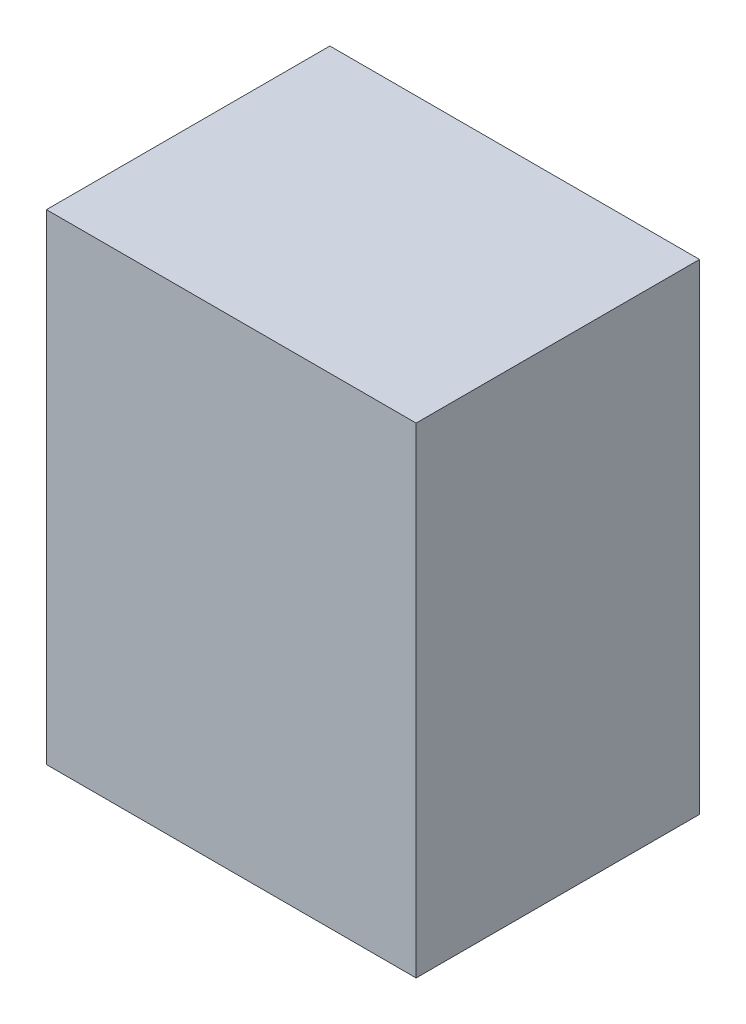
ISO-10303-21;
HEADER;
FILE_DESCRIPTION(('STEP AP214'),'2;1');
FILE_NAME('part.step','',(''),(''),'','','');
FILE_SCHEMA(('AUTOMOTIVE_DESIGN { 1 0 10303 214 1 1 1 1 }'));
ENDSEC;
DATA;
#1=APPLICATION_CONTEXT('core data for automotive mechanical design processes');
#2=APPLICATION_PROTOCOL_DEFINITION('international standard','automotive_design',2000,#1);
#3=PRODUCT_CONTEXT('',#1,'mechanical');
#4=PRODUCT('Part','Part','',(#3));
#5=PRODUCT_RELATED_PRODUCT_CATEGORY('part','',(#4));
#6=PRODUCT_DEFINITION_FORMATION('','',#4);
#7=PRODUCT_DEFINITION_CONTEXT('part definition',#1,'design');
#8=PRODUCT_DEFINITION('design','',#6,#7);
#9=PRODUCT_DEFINITION_SHAPE('','',#8);
#10=(LENGTH_UNIT() NAMED_UNIT(*) SI_UNIT(.MILLI.,.METRE.));
#11=(NAMED_UNIT(*) PLANE_ANGLE_UNIT() SI_UNIT($,.RADIAN.));
#12=(NAMED_UNIT(*) SI_UNIT($,.STERADIAN.) SOLID_ANGLE_UNIT());
#13=UNCERTAINTY_MEASURE_WITH_UNIT(LENGTH_MEASURE(1.E-05),#10,'distance_accuracy_value','');
#14=(GEOMETRIC_REPRESENTATION_CONTEXT(3) GLOBAL_UNCERTAINTY_ASSIGNED_CONTEXT((#13)) GLOBAL_UNIT_ASSIGNED_CONTEXT((#10,
#11,#12)) REPRESENTATION_CONTEXT('',''));
#15=CARTESIAN_POINT('',(0.,0.,0.));
#16=DIRECTION('',(0.,0.,1.));
#17=DIRECTION('',(1.,0.,0.));
#18=AXIS2_PLACEMENT_3D('',#15,#16,#17);
#19=CARTESIAN_POINT('',(-0.7499985,0.97499932,1.15000024));
#20=DIRECTION('',(0.,0.,1.));
#21=DIRECTION('',(1.,0.,0.));
#22=AXIS2_PLACEMENT_3D('',#19,#20,#21);
#23=PLANE('',#22);
#24=DIRECTION('',(0.,1.,0.));
#25=VECTOR('',#24,1.);
#26=CARTESIAN_POINT('',(0.75000104,0.97500186,1.15000024));
#27=LINE('',#26,#25);
#28=CARTESIAN_POINT('',(0.75000104,0.975001859999999,1.15000024));
#29=VERTEX_POINT('',#28);
#30=CARTESIAN_POINT('',(0.75000104,-0.97500059,1.15000024));
#31=VERTEX_POINT('',#30);
#32=EDGE_CURVE('E52',#29,#31,#27,.F.);
#33=ORIENTED_EDGE('',*,*,#32,.F.);
#34=DIRECTION('',(1.,0.,0.));
#35=VECTOR('',#34,1.);
#36=CARTESIAN_POINT('',(-0.7499985,0.97500186,1.15000024));
#37=LINE('',#36,#35);
#38=CARTESIAN_POINT('',(-0.7499985,0.97500059,1.15000024));
#39=VERTEX_POINT('',#38);
#40=EDGE_CURVE('E19',#29,#39,#37,.F.);
#41=ORIENTED_EDGE('',*,*,#40,.T.);
#42=DIRECTION('',(0.,1.,0.));
#43=VECTOR('',#42,1.);
#44=CARTESIAN_POINT('',(-0.7499985,-0.97499932,1.15000024));
#45=LINE('',#44,#43);
#46=CARTESIAN_POINT('',(-0.7499985,-0.974999320000001,1.15000024));
#47=VERTEX_POINT('',#46);
#48=EDGE_CURVE('E66',#47,#39,#45,.T.);
#49=ORIENTED_EDGE('',*,*,#48,.F.);
#50=DIRECTION('',(0.999999999998566,-1.69333385061627E-06,0.));
#51=VECTOR('',#50,1.);
#52=CARTESIAN_POINT('',(0.75000104,-0.97500186,1.15000024));
#53=LINE('',#52,#51);
#54=EDGE_CURVE('E57',#31,#47,#53,.F.);
#55=ORIENTED_EDGE('',*,*,#54,.F.);
#56=EDGE_LOOP('',(#33,#41,#49,#55));
#57=FACE_BOUND('',#56,.T.);
#58=ADVANCED_FACE('F16',(#57),#23,.T.);
#59=CARTESIAN_POINT('',(-0.7499985,-0.97499932,0.));
#60=DIRECTION('',(-1.,0.,0.));
#61=DIRECTION('',(0.,0.,1.));
#62=AXIS2_PLACEMENT_3D('',#59,#60,#61);
#63=PLANE('',#62);
#64=DIRECTION('',(0.,0.,1.));
#65=VECTOR('',#64,1.);
#66=CARTESIAN_POINT('',(-0.7499985,0.97499932,0.));
#67=LINE('',#66,#65);
#68=CARTESIAN_POINT('',(-0.7499985,0.974999955,0.));
#69=VERTEX_POINT('',#68);
#70=EDGE_CURVE('E79',#69,#39,#67,.T.);
#71=ORIENTED_EDGE('',*,*,#70,.F.);
#72=DIRECTION('',(0.,1.,0.));
#73=VECTOR('',#72,1.);
#74=CARTESIAN_POINT('',(-0.7499985,0.97499932,0.));
#75=LINE('',#74,#73);
#76=CARTESIAN_POINT('',(-0.7499985,-0.974999320000001,0.));
#77=VERTEX_POINT('',#76);
#78=EDGE_CURVE('E74',#69,#77,#75,.F.);
#79=ORIENTED_EDGE('',*,*,#78,.T.);
#80=DIRECTION('',(0.,0.,1.));
#81=VECTOR('',#80,1.);
#82=CARTESIAN_POINT('',(-0.7499985,-0.974999320000003,0.));
#83=LINE('',#82,#81);
#84=EDGE_CURVE('E62',#47,#77,#83,.F.);
#85=ORIENTED_EDGE('',*,*,#84,.F.);
#86=ORIENTED_EDGE('',*,*,#48,.T.);
#87=EDGE_LOOP('',(#71,#79,#85,#86));
#88=FACE_BOUND('',#87,.T.);
#89=ADVANCED_FACE('F73',(#88),#63,.T.);
#90=CARTESIAN_POINT('',(0.75000104,-0.97500186,0.));
#91=DIRECTION('',(-1.69333385061627E-06,-0.999999999998566,0.));
#92=DIRECTION('',(0.999999999998566,-1.69333385061627E-06,0.));
#93=AXIS2_PLACEMENT_3D('',#90,#91,#92);
#94=PLANE('',#93);
#95=ORIENTED_EDGE('',*,*,#84,.T.);
#96=DIRECTION('',(1.,0.,0.));
#97=VECTOR('',#96,1.);
#98=CARTESIAN_POINT('',(-0.7499985,-0.97499932,0.));
#99=LINE('',#98,#97);
#100=CARTESIAN_POINT('',(0.75000104,-0.975001225,0.));
#101=VERTEX_POINT('',#100);
#102=EDGE_CURVE('E83',#77,#101,#99,.T.);
#103=ORIENTED_EDGE('',*,*,#102,.T.);
#104=DIRECTION('',(0.,0.,-1.));
#105=VECTOR('',#104,1.);
#106=CARTESIAN_POINT('',(0.75000104,-0.97500186,0.));
#107=LINE('',#106,#105);
#108=EDGE_CURVE('E64',#31,#101,#107,.T.);
#109=ORIENTED_EDGE('',*,*,#108,.F.);
#110=ORIENTED_EDGE('',*,*,#54,.T.);
#111=EDGE_LOOP('',(#95,#103,#109,#110));
#112=FACE_BOUND('',#111,.T.);
#113=ADVANCED_FACE('F59',(#112),#94,.T.);
#114=CARTESIAN_POINT('',(0.75000104,0.97500186,0.));
#115=DIRECTION('',(1.,0.,0.));
#116=DIRECTION('',(0.,0.,-1.));
#117=AXIS2_PLACEMENT_3D('',#114,#115,#116);
#118=PLANE('',#117);
#119=ORIENTED_EDGE('',*,*,#108,.T.);
#120=DIRECTION('',(0.,1.,0.));
#121=VECTOR('',#120,1.);
#122=CARTESIAN_POINT('',(0.75000104,0.97499932,0.));
#123=LINE('',#122,#121);
#124=CARTESIAN_POINT('',(0.75000104,0.975001859999999,0.));
#125=VERTEX_POINT('',#124);
#126=EDGE_CURVE('E25',#101,#125,#123,.T.);
#127=ORIENTED_EDGE('',*,*,#126,.T.);
#128=DIRECTION('',(0.,0.,1.));
#129=VECTOR('',#128,1.);
#130=CARTESIAN_POINT('',(0.75000104,0.975001859999997,0.));
#131=LINE('',#130,#129);
#132=EDGE_CURVE('E33',#29,#125,#131,.F.);
#133=ORIENTED_EDGE('',*,*,#132,.F.);
#134=ORIENTED_EDGE('',*,*,#32,.T.);
#135=EDGE_LOOP('',(#119,#127,#133,#134));
#136=FACE_BOUND('',#135,.T.);
#137=ADVANCED_FACE('F87',(#136),#118,.T.);
#138=CARTESIAN_POINT('',(-0.7499985,0.97499932,0.));
#139=DIRECTION('',(-1.69333385061627E-06,0.999999999998566,0.));
#140=DIRECTION('',(-0.999999999998566,-1.69333385061627E-06,0.));
#141=AXIS2_PLACEMENT_3D('',#138,#139,#140);
#142=PLANE('',#141);
#143=ORIENTED_EDGE('',*,*,#132,.T.);
#144=DIRECTION('',(1.,0.,0.));
#145=VECTOR('',#144,1.);
#146=CARTESIAN_POINT('',(-0.7499985,0.97500186,0.));
#147=LINE('',#146,#145);
#148=EDGE_CURVE('E11',#125,#69,#147,.F.);
#149=ORIENTED_EDGE('',*,*,#148,.T.);
#150=ORIENTED_EDGE('',*,*,#70,.T.);
#151=ORIENTED_EDGE('',*,*,#40,.F.);
#152=EDGE_LOOP('',(#143,#149,#150,#151));
#153=FACE_BOUND('',#152,.T.);
#154=ADVANCED_FACE('F90',(#153),#142,.T.);
#155=CARTESIAN_POINT('',(-0.7499985,0.97499932,0.));
#156=DIRECTION('',(0.,0.,1.));
#157=DIRECTION('',(1.,0.,0.));
#158=AXIS2_PLACEMENT_3D('',#155,#156,#157);
#159=PLANE('',#158);
#160=ORIENTED_EDGE('',*,*,#126,.F.);
#161=ORIENTED_EDGE('',*,*,#102,.F.);
#162=ORIENTED_EDGE('',*,*,#78,.F.);
#163=ORIENTED_EDGE('',*,*,#148,.F.);
#164=EDGE_LOOP('',(#160,#161,#162,#163));
#165=FACE_BOUND('',#164,.T.);
#166=ADVANCED_FACE('F89',(#165),#159,.F.);
#167=CLOSED_SHELL('',(#58,#89,#113,#137,#154,#166));
#168=MANIFOLD_SOLID_BREP('B1',#167);
#169=ADVANCED_BREP_SHAPE_REPRESENTATION('',(#18,#168),#14);
#170=SHAPE_DEFINITION_REPRESENTATION(#9,#169);
ENDSEC;
END-ISO-10303-21;
